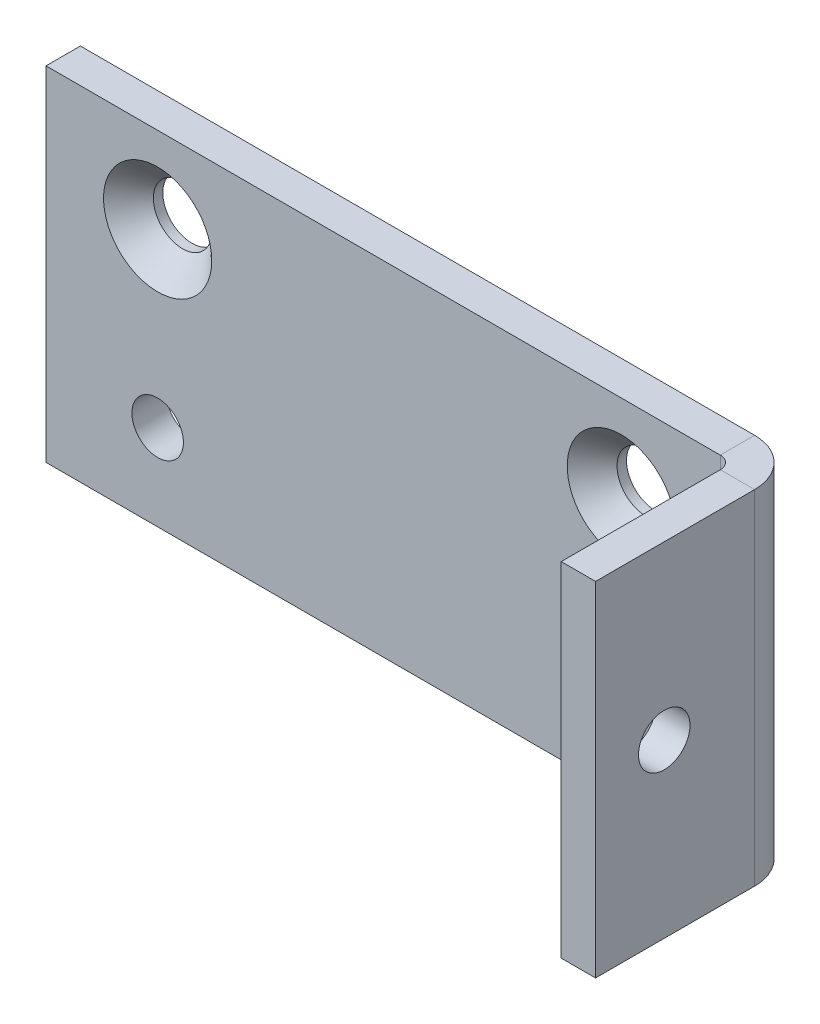
ISO-10303-21;
HEADER;
FILE_DESCRIPTION(('STEP AP214'),'2;1');
FILE_NAME('part.step','',(''),(''),'','','');
FILE_SCHEMA(('AUTOMOTIVE_DESIGN { 1 0 10303 214 1 1 1 1 }'));
ENDSEC;
DATA;
#1=APPLICATION_CONTEXT('core data for automotive mechanical design processes');
#2=APPLICATION_PROTOCOL_DEFINITION('international standard','automotive_design',2000,#1);
#3=PRODUCT_CONTEXT('',#1,'mechanical');
#4=PRODUCT('Part','Part','',(#3));
#5=PRODUCT_RELATED_PRODUCT_CATEGORY('part','',(#4));
#6=PRODUCT_DEFINITION_FORMATION('','',#4);
#7=PRODUCT_DEFINITION_CONTEXT('part definition',#1,'design');
#8=PRODUCT_DEFINITION('design','',#6,#7);
#9=PRODUCT_DEFINITION_SHAPE('','',#8);
#10=(LENGTH_UNIT() NAMED_UNIT(*) SI_UNIT(.MILLI.,.METRE.));
#11=(NAMED_UNIT(*) PLANE_ANGLE_UNIT() SI_UNIT($,.RADIAN.));
#12=(NAMED_UNIT(*) SI_UNIT($,.STERADIAN.) SOLID_ANGLE_UNIT());
#13=UNCERTAINTY_MEASURE_WITH_UNIT(LENGTH_MEASURE(1.E-05),#10,'distance_accuracy_value','');
#14=(GEOMETRIC_REPRESENTATION_CONTEXT(3) GLOBAL_UNCERTAINTY_ASSIGNED_CONTEXT((#13)) GLOBAL_UNIT_ASSIGNED_CONTEXT((#10,
#11,#12)) REPRESENTATION_CONTEXT('',''));
#15=CARTESIAN_POINT('',(0.,0.,0.));
#16=DIRECTION('',(0.,0.,1.));
#17=DIRECTION('',(1.,0.,0.));
#18=AXIS2_PLACEMENT_3D('',#15,#16,#17);
#19=CARTESIAN_POINT('',(-20.,10.,-2.));
#20=DIRECTION('',(0.,1.,0.));
#21=DIRECTION('',(-1.,0.,0.));
#22=AXIS2_PLACEMENT_3D('',#19,#20,#21);
#23=PLANE('',#22);
#24=DIRECTION('',(-1.,0.,0.));
#25=VECTOR('',#24,1.);
#26=CARTESIAN_POINT('',(-20.,10.,0.));
#27=LINE('',#26,#25);
#28=CARTESIAN_POINT('',(19.2634,10.,0.));
#29=VERTEX_POINT('',#28);
#30=CARTESIAN_POINT('',(-20.,10.,0.));
#31=VERTEX_POINT('',#30);
#32=EDGE_CURVE('E72',#29,#31,#27,.T.);
#33=ORIENTED_EDGE('',*,*,#32,.F.);
#34=DIRECTION('',(0.,0.,-1.));
#35=VECTOR('',#34,1.);
#36=CARTESIAN_POINT('',(19.2634,9.99999999999999,0.));
#37=LINE('',#36,#35);
#38=CARTESIAN_POINT('',(19.2634,9.99999999999999,-2.));
#39=VERTEX_POINT('',#38);
#40=EDGE_CURVE('E88',#29,#39,#37,.T.);
#41=ORIENTED_EDGE('',*,*,#40,.T.);
#42=DIRECTION('',(-1.,0.,0.));
#43=VECTOR('',#42,1.);
#44=CARTESIAN_POINT('',(-20.,10.,-2.));
#45=LINE('',#44,#43);
#46=CARTESIAN_POINT('',(-20.,10.,-2.));
#47=VERTEX_POINT('',#46);
#48=EDGE_CURVE('E61',#39,#47,#45,.T.);
#49=ORIENTED_EDGE('',*,*,#48,.T.);
#50=DIRECTION('',(0.,0.,1.));
#51=VECTOR('',#50,1.);
#52=CARTESIAN_POINT('',(-20.,10.,-2.));
#53=LINE('',#52,#51);
#54=EDGE_CURVE('E11',#47,#31,#53,.T.);
#55=ORIENTED_EDGE('',*,*,#54,.T.);
#56=EDGE_LOOP('',(#33,#41,#49,#55));
#57=FACE_BOUND('',#56,.T.);
#58=ADVANCED_FACE('F36',(#57),#23,.T.);
#59=CARTESIAN_POINT('',(0.,0.,-2.));
#60=DIRECTION('',(0.,0.,1.));
#61=DIRECTION('',(1.,0.,0.));
#62=AXIS2_PLACEMENT_3D('',#59,#60,#61);
#63=PLANE('',#62);
#64=CARTESIAN_POINT('',(13.5,-5.,-2.));
#65=DIRECTION('',(0.,0.,-1.));
#66=DIRECTION('',(-1.,0.,0.));
#67=AXIS2_PLACEMENT_3D('',#64,#65,#66);
#68=CIRCLE('',#67,1.49999999999999);
#69=CARTESIAN_POINT('',(12.,-5.,-2.));
#70=VERTEX_POINT('',#69);
#71=EDGE_CURVE('E110',#70,#70,#68,.T.);
#72=ORIENTED_EDGE('',*,*,#71,.F.);
#73=EDGE_LOOP('',(#72));
#74=FACE_BOUND('',#73,.T.);
#75=CARTESIAN_POINT('',(-13.5,-5.,-2.));
#76=DIRECTION('',(0.,0.,-1.));
#77=DIRECTION('',(-1.,0.,0.));
#78=AXIS2_PLACEMENT_3D('',#75,#76,#77);
#79=CIRCLE('',#78,1.49999999999999);
#80=CARTESIAN_POINT('',(-15.,-5.,-2.));
#81=VERTEX_POINT('',#80);
#82=EDGE_CURVE('E100',#81,#81,#79,.T.);
#83=ORIENTED_EDGE('',*,*,#82,.F.);
#84=EDGE_LOOP('',(#83));
#85=FACE_BOUND('',#84,.T.);
#86=CARTESIAN_POINT('',(-13.5,4.99999999999995,-2.));
#87=DIRECTION('',(0.,0.,1.));
#88=DIRECTION('',(1.,0.,0.));
#89=AXIS2_PLACEMENT_3D('',#86,#87,#88);
#90=CIRCLE('',#89,1.7);
#91=CARTESIAN_POINT('',(-11.8,4.99999999999995,-2.));
#92=VERTEX_POINT('',#91);
#93=EDGE_CURVE('E118',#92,#92,#90,.T.);
#94=ORIENTED_EDGE('',*,*,#93,.T.);
#95=EDGE_LOOP('',(#94));
#96=FACE_BOUND('',#95,.T.);
#97=CARTESIAN_POINT('',(13.5,4.99999999999994,-2.));
#98=DIRECTION('',(0.,0.,1.));
#99=DIRECTION('',(1.,0.,0.));
#100=AXIS2_PLACEMENT_3D('',#97,#98,#99);
#101=CIRCLE('',#100,1.7);
#102=CARTESIAN_POINT('',(15.2,4.99999999999994,-2.));
#103=VERTEX_POINT('',#102);
#104=EDGE_CURVE('E127',#103,#103,#101,.T.);
#105=ORIENTED_EDGE('',*,*,#104,.T.);
#106=EDGE_LOOP('',(#105));
#107=FACE_BOUND('',#106,.T.);
#108=DIRECTION('',(0.,1.,0.));
#109=VECTOR('',#108,1.);
#110=CARTESIAN_POINT('',(19.2634,10.,-2.));
#111=LINE('',#110,#109);
#112=CARTESIAN_POINT('',(19.2634,-9.99999999999998,-2.));
#113=VERTEX_POINT('',#112);
#114=EDGE_CURVE('E167',#39,#113,#111,.F.);
#115=ORIENTED_EDGE('',*,*,#114,.T.);
#116=DIRECTION('',(1.,0.,0.));
#117=VECTOR('',#116,1.);
#118=CARTESIAN_POINT('',(-20.,-10.,-2.));
#119=LINE('',#118,#117);
#120=CARTESIAN_POINT('',(-20.,-10.,-2.));
#121=VERTEX_POINT('',#120);
#122=EDGE_CURVE('E183',#121,#113,#119,.T.);
#123=ORIENTED_EDGE('',*,*,#122,.F.);
#124=DIRECTION('',(0.,-1.,0.));
#125=VECTOR('',#124,1.);
#126=CARTESIAN_POINT('',(-20.,10.,-2.));
#127=LINE('',#126,#125);
#128=EDGE_CURVE('E77',#47,#121,#127,.T.);
#129=ORIENTED_EDGE('',*,*,#128,.F.);
#130=ORIENTED_EDGE('',*,*,#48,.F.);
#131=EDGE_LOOP('',(#115,#123,#129,#130));
#132=FACE_BOUND('',#131,.T.);
#133=ADVANCED_FACE('F252',(#74,#85,#96,#107,#132),#63,.F.);
#134=CARTESIAN_POINT('',(0.,0.,0.));
#135=DIRECTION('',(0.,0.,1.));
#136=DIRECTION('',(1.,0.,0.));
#137=AXIS2_PLACEMENT_3D('',#134,#135,#136);
#138=PLANE('',#137);
#139=CARTESIAN_POINT('',(13.5,-5.,0.));
#140=DIRECTION('',(0.,0.,1.));
#141=DIRECTION('',(1.,0.,0.));
#142=AXIS2_PLACEMENT_3D('',#139,#140,#141);
#143=CIRCLE('',#142,1.49999999999999);
#144=CARTESIAN_POINT('',(15.,-5.,0.));
#145=VERTEX_POINT('',#144);
#146=EDGE_CURVE('E40',#145,#145,#143,.T.);
#147=ORIENTED_EDGE('',*,*,#146,.F.);
#148=EDGE_LOOP('',(#147));
#149=FACE_BOUND('',#148,.T.);
#150=CARTESIAN_POINT('',(-13.5,-5.,0.));
#151=DIRECTION('',(0.,0.,1.));
#152=DIRECTION('',(1.,0.,0.));
#153=AXIS2_PLACEMENT_3D('',#150,#151,#152);
#154=CIRCLE('',#153,1.49999999999999);
#155=CARTESIAN_POINT('',(-12.,-5.,0.));
#156=VERTEX_POINT('',#155);
#157=EDGE_CURVE('E98',#156,#156,#154,.T.);
#158=ORIENTED_EDGE('',*,*,#157,.F.);
#159=EDGE_LOOP('',(#158));
#160=FACE_BOUND('',#159,.T.);
#161=CARTESIAN_POINT('',(-13.5,4.99999999999995,0.));
#162=DIRECTION('',(0.,0.,1.));
#163=DIRECTION('',(1.,0.,0.));
#164=AXIS2_PLACEMENT_3D('',#161,#162,#163);
#165=CIRCLE('',#164,3.15);
#166=CARTESIAN_POINT('',(-10.35,4.99999999999995,0.));
#167=VERTEX_POINT('',#166);
#168=EDGE_CURVE('E96',#167,#167,#165,.T.);
#169=ORIENTED_EDGE('',*,*,#168,.F.);
#170=EDGE_LOOP('',(#169));
#171=FACE_BOUND('',#170,.T.);
#172=CARTESIAN_POINT('',(13.5,4.99999999999994,0.));
#173=DIRECTION('',(0.,0.,1.));
#174=DIRECTION('',(1.,0.,0.));
#175=AXIS2_PLACEMENT_3D('',#172,#173,#174);
#176=CIRCLE('',#175,3.15);
#177=CARTESIAN_POINT('',(16.65,4.99999999999994,0.));
#178=VERTEX_POINT('',#177);
#179=EDGE_CURVE('E121',#178,#178,#176,.T.);
#180=ORIENTED_EDGE('',*,*,#179,.F.);
#181=EDGE_LOOP('',(#180));
#182=FACE_BOUND('',#181,.T.);
#183=DIRECTION('',(1.,0.,0.));
#184=VECTOR('',#183,1.);
#185=CARTESIAN_POINT('',(-20.,-10.,0.));
#186=LINE('',#185,#184);
#187=CARTESIAN_POINT('',(-20.,-10.,0.));
#188=VERTEX_POINT('',#187);
#189=CARTESIAN_POINT('',(19.2634,-10.,0.));
#190=VERTEX_POINT('',#189);
#191=EDGE_CURVE('E78',#188,#190,#186,.T.);
#192=ORIENTED_EDGE('',*,*,#191,.T.);
#193=DIRECTION('',(0.,1.,0.));
#194=VECTOR('',#193,1.);
#195=CARTESIAN_POINT('',(19.2634,10.,0.));
#196=LINE('',#195,#194);
#197=EDGE_CURVE('E53',#29,#190,#196,.F.);
#198=ORIENTED_EDGE('',*,*,#197,.F.);
#199=ORIENTED_EDGE('',*,*,#32,.T.);
#200=DIRECTION('',(0.,-1.,0.));
#201=VECTOR('',#200,1.);
#202=CARTESIAN_POINT('',(-20.,10.,0.));
#203=LINE('',#202,#201);
#204=EDGE_CURVE('E75',#31,#188,#203,.T.);
#205=ORIENTED_EDGE('',*,*,#204,.T.);
#206=EDGE_LOOP('',(#192,#198,#199,#205));
#207=FACE_BOUND('',#206,.T.);
#208=ADVANCED_FACE('F73',(#149,#160,#171,#182,#207),#138,.T.);
#209=CARTESIAN_POINT('',(-20.,10.,-2.));
#210=DIRECTION('',(-1.,0.,0.));
#211=DIRECTION('',(0.,0.,1.));
#212=AXIS2_PLACEMENT_3D('',#209,#210,#211);
#213=PLANE('',#212);
#214=ORIENTED_EDGE('',*,*,#204,.F.);
#215=ORIENTED_EDGE('',*,*,#54,.F.);
#216=ORIENTED_EDGE('',*,*,#128,.T.);
#217=DIRECTION('',(0.,0.,1.));
#218=VECTOR('',#217,1.);
#219=CARTESIAN_POINT('',(-20.,-10.,-2.));
#220=LINE('',#219,#218);
#221=EDGE_CURVE('E45',#121,#188,#220,.T.);
#222=ORIENTED_EDGE('',*,*,#221,.T.);
#223=EDGE_LOOP('',(#214,#215,#216,#222));
#224=FACE_BOUND('',#223,.T.);
#225=ADVANCED_FACE('F38',(#224),#213,.T.);
#226=CARTESIAN_POINT('',(-20.,-10.,-2.));
#227=DIRECTION('',(0.,-1.,0.));
#228=DIRECTION('',(1.,0.,0.));
#229=AXIS2_PLACEMENT_3D('',#226,#227,#228);
#230=PLANE('',#229);
#231=DIRECTION('',(0.,0.,-1.));
#232=VECTOR('',#231,1.);
#233=CARTESIAN_POINT('',(19.2634,-10.,0.));
#234=LINE('',#233,#232);
#235=EDGE_CURVE('E84',#190,#113,#234,.T.);
#236=ORIENTED_EDGE('',*,*,#235,.F.);
#237=ORIENTED_EDGE('',*,*,#191,.F.);
#238=ORIENTED_EDGE('',*,*,#221,.F.);
#239=ORIENTED_EDGE('',*,*,#122,.T.);
#240=EDGE_LOOP('',(#236,#237,#238,#239));
#241=FACE_BOUND('',#240,.T.);
#242=ADVANCED_FACE('F188',(#241),#230,.T.);
#243=CARTESIAN_POINT('',(19.2634,-10.,0.7366));
#244=DIRECTION('',(0.,-1.,0.));
#245=DIRECTION('',(0.,0.,-1.));
#246=AXIS2_PLACEMENT_3D('',#243,#244,#245);
#247=PLANE('',#246);
#248=DIRECTION('',(1.,0.,0.));
#249=VECTOR('',#248,1.);
#250=CARTESIAN_POINT('',(20.,-10.,0.736599999999997));
#251=LINE('',#250,#249);
#252=CARTESIAN_POINT('',(20.,-10.,0.736599999999997));
#253=VERTEX_POINT('',#252);
#254=CARTESIAN_POINT('',(22.,-10.,0.73659999999999));
#255=VERTEX_POINT('',#254);
#256=EDGE_CURVE('E130',#253,#255,#251,.T.);
#257=ORIENTED_EDGE('',*,*,#256,.F.);
#258=CARTESIAN_POINT('',(19.2634,-10.,0.7366));
#259=DIRECTION('',(0.,1.,0.));
#260=DIRECTION('',(0.,0.,1.));
#261=AXIS2_PLACEMENT_3D('',#258,#259,#260);
#262=CIRCLE('',#261,0.7366);
#263=EDGE_CURVE('E176',#190,#253,#262,.F.);
#264=ORIENTED_EDGE('',*,*,#263,.F.);
#265=ORIENTED_EDGE('',*,*,#235,.T.);
#266=CARTESIAN_POINT('',(19.2634,-10.,0.7366));
#267=DIRECTION('',(0.,1.,0.));
#268=DIRECTION('',(0.,0.,1.));
#269=AXIS2_PLACEMENT_3D('',#266,#267,#268);
#270=CIRCLE('',#269,2.7366);
#271=EDGE_CURVE('E170',#113,#255,#270,.F.);
#272=ORIENTED_EDGE('',*,*,#271,.T.);
#273=EDGE_LOOP('',(#257,#264,#265,#272));
#274=FACE_BOUND('',#273,.T.);
#275=ADVANCED_FACE('F195',(#274),#247,.T.);
#276=CARTESIAN_POINT('',(19.2634,9.99999999999999,0.7366));
#277=DIRECTION('',(0.,-1.,0.));
#278=DIRECTION('',(0.,0.,-1.));
#279=AXIS2_PLACEMENT_3D('',#276,#277,#278);
#280=PLANE('',#279);
#281=CARTESIAN_POINT('',(19.2634,9.99999999999999,0.7366));
#282=DIRECTION('',(0.,1.,0.));
#283=DIRECTION('',(0.,0.,1.));
#284=AXIS2_PLACEMENT_3D('',#281,#282,#283);
#285=CIRCLE('',#284,0.7366);
#286=CARTESIAN_POINT('',(20.,9.99999999999999,0.736599999999997));
#287=VERTEX_POINT('',#286);
#288=EDGE_CURVE('E166',#287,#29,#285,.T.);
#289=ORIENTED_EDGE('',*,*,#288,.F.);
#290=DIRECTION('',(1.,0.,0.));
#291=VECTOR('',#290,1.);
#292=CARTESIAN_POINT('',(20.,9.99999999999999,0.736599999999997));
#293=LINE('',#292,#291);
#294=CARTESIAN_POINT('',(22.,9.99999999999999,0.73659999999999));
#295=VERTEX_POINT('',#294);
#296=EDGE_CURVE('E134',#287,#295,#293,.T.);
#297=ORIENTED_EDGE('',*,*,#296,.T.);
#298=CARTESIAN_POINT('',(19.2634,9.99999999999999,0.7366));
#299=DIRECTION('',(0.,1.,0.));
#300=DIRECTION('',(0.,0.,1.));
#301=AXIS2_PLACEMENT_3D('',#298,#299,#300);
#302=CIRCLE('',#301,2.7366);
#303=EDGE_CURVE('E171',#295,#39,#302,.T.);
#304=ORIENTED_EDGE('',*,*,#303,.T.);
#305=ORIENTED_EDGE('',*,*,#40,.F.);
#306=EDGE_LOOP('',(#289,#297,#304,#305));
#307=FACE_BOUND('',#306,.T.);
#308=ADVANCED_FACE('F241',(#307),#280,.F.);
#309=CARTESIAN_POINT('',(19.2634,10.,0.7366));
#310=DIRECTION('',(0.,1.,0.));
#311=DIRECTION('',(1.,0.,0.));
#312=AXIS2_PLACEMENT_3D('',#309,#310,#311);
#313=CYLINDRICAL_SURFACE('',#312,2.7366);
#314=ORIENTED_EDGE('',*,*,#114,.F.);
#315=ORIENTED_EDGE('',*,*,#303,.F.);
#316=DIRECTION('',(0.,-1.,0.));
#317=VECTOR('',#316,1.);
#318=CARTESIAN_POINT('',(22.,0.,0.73659999999999));
#319=LINE('',#318,#317);
#320=EDGE_CURVE('E137',#295,#255,#319,.T.);
#321=ORIENTED_EDGE('',*,*,#320,.T.);
#322=ORIENTED_EDGE('',*,*,#271,.F.);
#323=EDGE_LOOP('',(#314,#315,#321,#322));
#324=FACE_BOUND('',#323,.T.);
#325=ADVANCED_FACE('F199',(#324),#313,.T.);
#326=CARTESIAN_POINT('',(19.2634,10.,0.7366));
#327=DIRECTION('',(0.,1.,0.));
#328=DIRECTION('',(1.,0.,0.));
#329=AXIS2_PLACEMENT_3D('',#326,#327,#328);
#330=CYLINDRICAL_SURFACE('',#329,0.7366);
#331=ORIENTED_EDGE('',*,*,#197,.T.);
#332=ORIENTED_EDGE('',*,*,#263,.T.);
#333=DIRECTION('',(0.,1.,0.));
#334=VECTOR('',#333,1.);
#335=CARTESIAN_POINT('',(20.,-10.,0.736599999999997));
#336=LINE('',#335,#334);
#337=EDGE_CURVE('E131',#253,#287,#336,.T.);
#338=ORIENTED_EDGE('',*,*,#337,.T.);
#339=ORIENTED_EDGE('',*,*,#288,.T.);
#340=EDGE_LOOP('',(#331,#332,#338,#339));
#341=FACE_BOUND('',#340,.T.);
#342=ADVANCED_FACE('F237',(#341),#330,.F.);
#343=CARTESIAN_POINT('',(22.,-10.,0.));
#344=DIRECTION('',(0.,1.,0.));
#345=DIRECTION('',(0.,0.,1.));
#346=AXIS2_PLACEMENT_3D('',#343,#344,#345);
#347=PLANE('',#346);
#348=ORIENTED_EDGE('',*,*,#256,.T.);
#349=DIRECTION('',(0.,0.,-1.));
#350=VECTOR('',#349,1.);
#351=CARTESIAN_POINT('',(22.,-10.,0.));
#352=LINE('',#351,#350);
#353=CARTESIAN_POINT('',(22.,-10.,10.));
#354=VERTEX_POINT('',#353);
#355=EDGE_CURVE('E143',#354,#255,#352,.T.);
#356=ORIENTED_EDGE('',*,*,#355,.F.);
#357=DIRECTION('',(-1.,0.,0.));
#358=VECTOR('',#357,1.);
#359=CARTESIAN_POINT('',(22.,-10.,10.));
#360=LINE('',#359,#358);
#361=CARTESIAN_POINT('',(20.,-10.,10.));
#362=VERTEX_POINT('',#361);
#363=EDGE_CURVE('E153',#354,#362,#360,.T.);
#364=ORIENTED_EDGE('',*,*,#363,.T.);
#365=DIRECTION('',(0.,0.,-1.));
#366=VECTOR('',#365,1.);
#367=CARTESIAN_POINT('',(20.,-10.,0.));
#368=LINE('',#367,#366);
#369=EDGE_CURVE('E142',#362,#253,#368,.T.);
#370=ORIENTED_EDGE('',*,*,#369,.T.);
#371=EDGE_LOOP('',(#348,#356,#364,#370));
#372=FACE_BOUND('',#371,.T.);
#373=ADVANCED_FACE('F305',(#372),#347,.F.);
#374=CARTESIAN_POINT('',(22.,10.,10.));
#375=DIRECTION('',(0.,-1.,0.));
#376=DIRECTION('',(0.,0.,-1.));
#377=AXIS2_PLACEMENT_3D('',#374,#375,#376);
#378=PLANE('',#377);
#379=ORIENTED_EDGE('',*,*,#296,.F.);
#380=DIRECTION('',(0.,0.,1.));
#381=VECTOR('',#380,1.);
#382=CARTESIAN_POINT('',(20.,10.,10.));
#383=LINE('',#382,#381);
#384=CARTESIAN_POINT('',(20.,10.,10.));
#385=VERTEX_POINT('',#384);
#386=EDGE_CURVE('E156',#287,#385,#383,.T.);
#387=ORIENTED_EDGE('',*,*,#386,.T.);
#388=DIRECTION('',(-1.,0.,0.));
#389=VECTOR('',#388,1.);
#390=CARTESIAN_POINT('',(22.,10.,10.));
#391=LINE('',#390,#389);
#392=CARTESIAN_POINT('',(22.,10.,10.));
#393=VERTEX_POINT('',#392);
#394=EDGE_CURVE('E163',#393,#385,#391,.T.);
#395=ORIENTED_EDGE('',*,*,#394,.F.);
#396=DIRECTION('',(0.,0.,1.));
#397=VECTOR('',#396,1.);
#398=CARTESIAN_POINT('',(22.,10.,10.));
#399=LINE('',#398,#397);
#400=EDGE_CURVE('E146',#295,#393,#399,.T.);
#401=ORIENTED_EDGE('',*,*,#400,.F.);
#402=EDGE_LOOP('',(#379,#387,#395,#401));
#403=FACE_BOUND('',#402,.T.);
#404=ADVANCED_FACE('F216',(#403),#378,.F.);
#405=CARTESIAN_POINT('',(22.,0.,0.));
#406=DIRECTION('',(-1.,0.,0.));
#407=DIRECTION('',(0.,0.,1.));
#408=AXIS2_PLACEMENT_3D('',#405,#406,#407);
#409=PLANE('',#408);
#410=CARTESIAN_POINT('',(22.,0.,5.99999999999999));
#411=DIRECTION('',(1.,0.,0.));
#412=DIRECTION('',(0.,0.,-1.));
#413=AXIS2_PLACEMENT_3D('',#410,#411,#412);
#414=CIRCLE('',#413,1.49999999999999);
#415=CARTESIAN_POINT('',(22.,0.,4.5));
#416=VERTEX_POINT('',#415);
#417=EDGE_CURVE('E97',#416,#416,#414,.T.);
#418=ORIENTED_EDGE('',*,*,#417,.F.);
#419=EDGE_LOOP('',(#418));
#420=FACE_BOUND('',#419,.T.);
#421=ORIENTED_EDGE('',*,*,#320,.F.);
#422=ORIENTED_EDGE('',*,*,#400,.T.);
#423=DIRECTION('',(0.,-1.,0.));
#424=VECTOR('',#423,1.);
#425=CARTESIAN_POINT('',(22.,-10.,10.));
#426=LINE('',#425,#424);
#427=EDGE_CURVE('E150',#393,#354,#426,.T.);
#428=ORIENTED_EDGE('',*,*,#427,.T.);
#429=ORIENTED_EDGE('',*,*,#355,.T.);
#430=EDGE_LOOP('',(#421,#422,#428,#429));
#431=FACE_BOUND('',#430,.T.);
#432=ADVANCED_FACE('F208',(#420,#431),#409,.F.);
#433=CARTESIAN_POINT('',(20.,0.,0.));
#434=DIRECTION('',(-1.,0.,0.));
#435=DIRECTION('',(0.,0.,1.));
#436=AXIS2_PLACEMENT_3D('',#433,#434,#435);
#437=PLANE('',#436);
#438=CARTESIAN_POINT('',(20.,0.,6.));
#439=DIRECTION('',(-1.,0.,0.));
#440=DIRECTION('',(0.,0.,1.));
#441=AXIS2_PLACEMENT_3D('',#438,#439,#440);
#442=CIRCLE('',#441,1.49999999999999);
#443=CARTESIAN_POINT('',(20.,0.,7.49999999999999));
#444=VERTEX_POINT('',#443);
#445=EDGE_CURVE('E94',#444,#444,#442,.T.);
#446=ORIENTED_EDGE('',*,*,#445,.F.);
#447=EDGE_LOOP('',(#446));
#448=FACE_BOUND('',#447,.T.);
#449=ORIENTED_EDGE('',*,*,#386,.F.);
#450=ORIENTED_EDGE('',*,*,#337,.F.);
#451=ORIENTED_EDGE('',*,*,#369,.F.);
#452=DIRECTION('',(0.,-1.,0.));
#453=VECTOR('',#452,1.);
#454=CARTESIAN_POINT('',(20.,-10.,10.));
#455=LINE('',#454,#453);
#456=EDGE_CURVE('E147',#385,#362,#455,.T.);
#457=ORIENTED_EDGE('',*,*,#456,.F.);
#458=EDGE_LOOP('',(#449,#450,#451,#457));
#459=FACE_BOUND('',#458,.T.);
#460=ADVANCED_FACE('F296',(#448,#459),#437,.T.);
#461=CARTESIAN_POINT('',(22.,-10.,10.));
#462=DIRECTION('',(0.,0.,-1.));
#463=DIRECTION('',(-1.,0.,0.));
#464=AXIS2_PLACEMENT_3D('',#461,#462,#463);
#465=PLANE('',#464);
#466=ORIENTED_EDGE('',*,*,#456,.T.);
#467=ORIENTED_EDGE('',*,*,#363,.F.);
#468=ORIENTED_EDGE('',*,*,#427,.F.);
#469=ORIENTED_EDGE('',*,*,#394,.T.);
#470=EDGE_LOOP('',(#466,#467,#468,#469));
#471=FACE_BOUND('',#470,.T.);
#472=ADVANCED_FACE('F225',(#471),#465,.F.);
#473=CARTESIAN_POINT('',(13.5,4.99999999999994,0.));
#474=DIRECTION('',(0.,0.,1.));
#475=DIRECTION('',(1.,0.,0.));
#476=AXIS2_PLACEMENT_3D('',#473,#474,#475);
#477=CYLINDRICAL_SURFACE('',#476,1.69999999999999);
#478=ORIENTED_EDGE('',*,*,#104,.F.);
#479=EDGE_LOOP('',(#478));
#480=FACE_BOUND('',#479,.T.);
#481=CARTESIAN_POINT('',(13.5,4.99999999999994,-1.45000000000001));
#482=DIRECTION('',(0.,0.,1.));
#483=DIRECTION('',(1.,0.,0.));
#484=AXIS2_PLACEMENT_3D('',#481,#482,#483);
#485=CIRCLE('',#484,1.69999999999999);
#486=CARTESIAN_POINT('',(15.2,4.99999999999994,-1.45000000000001));
#487=VERTEX_POINT('',#486);
#488=EDGE_CURVE('E124',#487,#487,#485,.T.);
#489=ORIENTED_EDGE('',*,*,#488,.T.);
#490=EDGE_LOOP('',(#489));
#491=FACE_BOUND('',#490,.T.);
#492=ADVANCED_FACE('F279',(#480,#491),#477,.F.);
#493=CARTESIAN_POINT('',(13.5,4.99999999999994,0.));
#494=DIRECTION('',(0.,0.,1.));
#495=DIRECTION('',(1.,0.,0.));
#496=AXIS2_PLACEMENT_3D('',#493,#494,#495);
#497=CONICAL_SURFACE('',#496,3.15,0.78539816339745);
#498=ORIENTED_EDGE('',*,*,#488,.F.);
#499=EDGE_LOOP('',(#498));
#500=FACE_BOUND('',#499,.T.);
#501=ORIENTED_EDGE('',*,*,#179,.T.);
#502=EDGE_LOOP('',(#501));
#503=FACE_BOUND('',#502,.T.);
#504=ADVANCED_FACE('F276',(#500,#503),#497,.F.);
#505=CARTESIAN_POINT('',(-13.5,4.99999999999995,0.));
#506=DIRECTION('',(0.,0.,1.));
#507=DIRECTION('',(1.,0.,0.));
#508=AXIS2_PLACEMENT_3D('',#505,#506,#507);
#509=CYLINDRICAL_SURFACE('',#508,1.69999999999999);
#510=ORIENTED_EDGE('',*,*,#93,.F.);
#511=EDGE_LOOP('',(#510));
#512=FACE_BOUND('',#511,.T.);
#513=CARTESIAN_POINT('',(-13.5,4.99999999999995,-1.45000000000001));
#514=DIRECTION('',(0.,0.,1.));
#515=DIRECTION('',(1.,0.,0.));
#516=AXIS2_PLACEMENT_3D('',#513,#514,#515);
#517=CIRCLE('',#516,1.69999999999999);
#518=CARTESIAN_POINT('',(-11.8,4.99999999999995,-1.45000000000001));
#519=VERTEX_POINT('',#518);
#520=EDGE_CURVE('E115',#519,#519,#517,.T.);
#521=ORIENTED_EDGE('',*,*,#520,.T.);
#522=EDGE_LOOP('',(#521));
#523=FACE_BOUND('',#522,.T.);
#524=ADVANCED_FACE('F278',(#512,#523),#509,.F.);
#525=CARTESIAN_POINT('',(-13.5,4.99999999999995,0.));
#526=DIRECTION('',(0.,0.,1.));
#527=DIRECTION('',(1.,0.,0.));
#528=AXIS2_PLACEMENT_3D('',#525,#526,#527);
#529=CONICAL_SURFACE('',#528,3.15,0.78539816339745);
#530=ORIENTED_EDGE('',*,*,#520,.F.);
#531=EDGE_LOOP('',(#530));
#532=FACE_BOUND('',#531,.T.);
#533=ORIENTED_EDGE('',*,*,#168,.T.);
#534=EDGE_LOOP('',(#533));
#535=FACE_BOUND('',#534,.T.);
#536=ADVANCED_FACE('F286',(#532,#535),#529,.F.);
#537=CARTESIAN_POINT('',(22.,0.,5.99999999999999));
#538=DIRECTION('',(1.,0.,0.));
#539=DIRECTION('',(0.,0.,-1.));
#540=AXIS2_PLACEMENT_3D('',#537,#538,#539);
#541=CYLINDRICAL_SURFACE('',#540,1.49999999999999);
#542=ORIENTED_EDGE('',*,*,#445,.T.);
#543=EDGE_LOOP('',(#542));
#544=FACE_BOUND('',#543,.T.);
#545=ORIENTED_EDGE('',*,*,#417,.T.);
#546=EDGE_LOOP('',(#545));
#547=FACE_BOUND('',#546,.T.);
#548=ADVANCED_FACE('F357',(#544,#547),#541,.F.);
#549=CARTESIAN_POINT('',(-13.5,-5.,-2.));
#550=DIRECTION('',(0.,0.,-1.));
#551=DIRECTION('',(-1.,0.,0.));
#552=AXIS2_PLACEMENT_3D('',#549,#550,#551);
#553=CYLINDRICAL_SURFACE('',#552,1.49999999999999);
#554=ORIENTED_EDGE('',*,*,#157,.T.);
#555=EDGE_LOOP('',(#554));
#556=FACE_BOUND('',#555,.T.);
#557=ORIENTED_EDGE('',*,*,#82,.T.);
#558=EDGE_LOOP('',(#557));
#559=FACE_BOUND('',#558,.T.);
#560=ADVANCED_FACE('F366',(#556,#559),#553,.F.);
#561=CARTESIAN_POINT('',(13.5,-5.,-2.));
#562=DIRECTION('',(0.,0.,-1.));
#563=DIRECTION('',(-1.,0.,0.));
#564=AXIS2_PLACEMENT_3D('',#561,#562,#563);
#565=CYLINDRICAL_SURFACE('',#564,1.49999999999999);
#566=ORIENTED_EDGE('',*,*,#146,.T.);
#567=EDGE_LOOP('',(#566));
#568=FACE_BOUND('',#567,.T.);
#569=ORIENTED_EDGE('',*,*,#71,.T.);
#570=EDGE_LOOP('',(#569));
#571=FACE_BOUND('',#570,.T.);
#572=ADVANCED_FACE('F374',(#568,#571),#565,.F.);
#573=CLOSED_SHELL('',(#58,#133,#208,#225,#242,#275,#308,#325,#342,#373,#404,#432,#460,#472,#492,
#504,#524,#536,#548,#560,#572));
#574=MANIFOLD_SOLID_BREP('B2',#573);
#575=ADVANCED_BREP_SHAPE_REPRESENTATION('',(#18,#574),#14);
#576=SHAPE_DEFINITION_REPRESENTATION(#9,#575);
ENDSEC;
END-ISO-10303-21;
